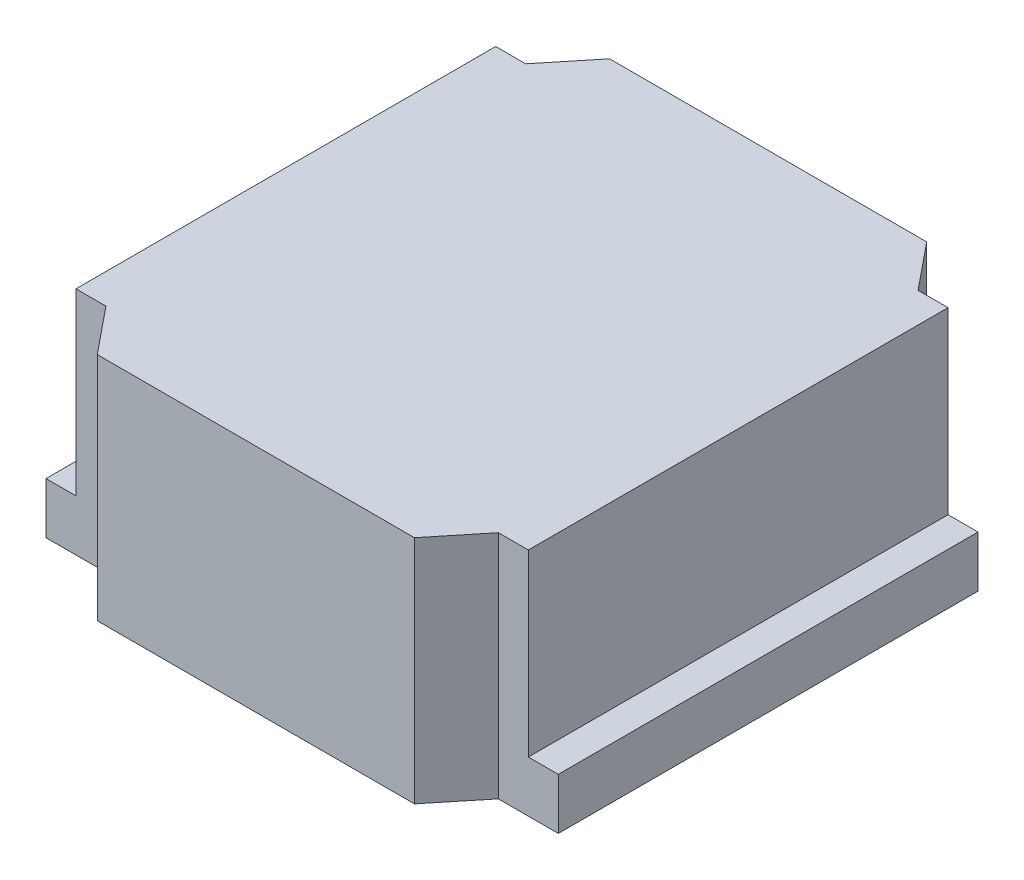
ISO-10303-21;
HEADER;
FILE_DESCRIPTION(('STEP AP214'),'2;1');
FILE_NAME('part.step','',(''),(''),'','','');
FILE_SCHEMA(('AUTOMOTIVE_DESIGN { 1 0 10303 214 1 1 1 1 }'));
ENDSEC;
DATA;
#1=APPLICATION_CONTEXT('core data for automotive mechanical design processes');
#2=APPLICATION_PROTOCOL_DEFINITION('international standard','automotive_design',2000,#1);
#3=PRODUCT_CONTEXT('',#1,'mechanical');
#4=PRODUCT('Part','Part','',(#3));
#5=PRODUCT_RELATED_PRODUCT_CATEGORY('part','',(#4));
#6=PRODUCT_DEFINITION_FORMATION('','',#4);
#7=PRODUCT_DEFINITION_CONTEXT('part definition',#1,'design');
#8=PRODUCT_DEFINITION('design','',#6,#7);
#9=PRODUCT_DEFINITION_SHAPE('','',#8);
#10=(LENGTH_UNIT() NAMED_UNIT(*) SI_UNIT(.MILLI.,.METRE.));
#11=(NAMED_UNIT(*) PLANE_ANGLE_UNIT() SI_UNIT($,.RADIAN.));
#12=(NAMED_UNIT(*) SI_UNIT($,.STERADIAN.) SOLID_ANGLE_UNIT());
#13=UNCERTAINTY_MEASURE_WITH_UNIT(LENGTH_MEASURE(1.E-05),#10,'distance_accuracy_value','');
#14=(GEOMETRIC_REPRESENTATION_CONTEXT(3) GLOBAL_UNCERTAINTY_ASSIGNED_CONTEXT((#13)) GLOBAL_UNIT_ASSIGNED_CONTEXT((#10,
#11,#12)) REPRESENTATION_CONTEXT('',''));
#15=CARTESIAN_POINT('',(0.,0.,0.));
#16=DIRECTION('',(0.,0.,1.));
#17=DIRECTION('',(1.,0.,0.));
#18=AXIS2_PLACEMENT_3D('',#15,#16,#17);
#19=CARTESIAN_POINT('',(6.23198911933,0.85,-22.06354621674));
#20=DIRECTION('',(0.,0.,1.));
#21=DIRECTION('',(1.,0.,0.));
#22=AXIS2_PLACEMENT_3D('',#19,#20,#21);
#23=PLANE('',#22);
#24=DIRECTION('',(1.,0.,0.));
#25=VECTOR('',#24,1.);
#26=CARTESIAN_POINT('',(6.465994559665,0.85,-22.06354621674));
#27=LINE('',#26,#25);
#28=CARTESIAN_POINT('',(6.23198911933,0.85,-22.0635462167398));
#29=VERTEX_POINT('',#28);
#30=CARTESIAN_POINT('',(6.7,0.85,-22.0635462167398));
#31=VERTEX_POINT('',#30);
#32=EDGE_CURVE('E248',#29,#31,#27,.T.);
#33=ORIENTED_EDGE('',*,*,#32,.F.);
#34=DIRECTION('',(0.,1.,0.));
#35=VECTOR('',#34,1.);
#36=CARTESIAN_POINT('',(6.23198911933,1.75,-22.06354621674));
#37=LINE('',#36,#35);
#38=CARTESIAN_POINT('',(6.23198911932959,2.65,-22.06354621674));
#39=VERTEX_POINT('',#38);
#40=EDGE_CURVE('E159',#29,#39,#37,.T.);
#41=ORIENTED_EDGE('',*,*,#40,.T.);
#42=DIRECTION('',(-1.,0.,0.));
#43=VECTOR('',#42,1.);
#44=CARTESIAN_POINT('',(6.465994559665,2.65,-22.06354621674));
#45=LINE('',#44,#43);
#46=CARTESIAN_POINT('',(6.46599455966502,2.65,-22.0635462167398));
#47=VERTEX_POINT('',#46);
#48=EDGE_CURVE('E251',#47,#39,#45,.T.);
#49=ORIENTED_EDGE('',*,*,#48,.F.);
#50=DIRECTION('',(0.,1.,0.));
#51=VECTOR('',#50,1.);
#52=CARTESIAN_POINT('',(6.465994559665,1.95,-22.06354621674));
#53=LINE('',#52,#51);
#54=CARTESIAN_POINT('',(6.46599455966503,1.25,-22.06354621674));
#55=VERTEX_POINT('',#54);
#56=EDGE_CURVE('E221',#55,#47,#53,.T.);
#57=ORIENTED_EDGE('',*,*,#56,.F.);
#58=DIRECTION('',(-1.,0.,0.));
#59=VECTOR('',#58,1.);
#60=CARTESIAN_POINT('',(6.465994559665,1.25,-22.06354621674));
#61=LINE('',#60,#59);
#62=CARTESIAN_POINT('',(6.7,1.25,-22.06354621674));
#63=VERTEX_POINT('',#62);
#64=EDGE_CURVE('E252',#63,#55,#61,.T.);
#65=ORIENTED_EDGE('',*,*,#64,.F.);
#66=DIRECTION('',(0.,1.,0.));
#67=VECTOR('',#66,1.);
#68=CARTESIAN_POINT('',(6.7,1.75,-22.06354621674));
#69=LINE('',#68,#67);
#70=EDGE_CURVE('E166',#31,#63,#69,.T.);
#71=ORIENTED_EDGE('',*,*,#70,.F.);
#72=EDGE_LOOP('',(#33,#41,#49,#57,#65,#71));
#73=FACE_BOUND('',#72,.T.);
#74=ADVANCED_FACE('F17',(#73),#23,.F.);
#75=CARTESIAN_POINT('',(2.7,0.85,-22.06354621674));
#76=DIRECTION('',(0.,0.,1.));
#77=DIRECTION('',(1.,0.,0.));
#78=AXIS2_PLACEMENT_3D('',#75,#76,#77);
#79=PLANE('',#78);
#80=DIRECTION('',(0.,-1.,0.));
#81=VECTOR('',#80,1.);
#82=CARTESIAN_POINT('',(2.7,1.75,-22.06354621674));
#83=LINE('',#82,#81);
#84=CARTESIAN_POINT('',(2.7,1.25,-22.06354621674));
#85=VERTEX_POINT('',#84);
#86=CARTESIAN_POINT('',(2.7,0.85,-22.0635462167398));
#87=VERTEX_POINT('',#86);
#88=EDGE_CURVE('E241',#85,#87,#83,.T.);
#89=ORIENTED_EDGE('',*,*,#88,.F.);
#90=DIRECTION('',(-1.,0.,0.));
#91=VECTOR('',#90,1.);
#92=CARTESIAN_POINT('',(2.934005440335,1.25,-22.06354621674));
#93=LINE('',#92,#91);
#94=CARTESIAN_POINT('',(2.93400544033503,1.25,-22.06354621674));
#95=VERTEX_POINT('',#94);
#96=EDGE_CURVE('E165',#95,#85,#93,.T.);
#97=ORIENTED_EDGE('',*,*,#96,.F.);
#98=DIRECTION('',(0.,-1.,0.));
#99=VECTOR('',#98,1.);
#100=CARTESIAN_POINT('',(2.934005440335,1.95,-22.06354621674));
#101=LINE('',#100,#99);
#102=CARTESIAN_POINT('',(2.93400544033502,2.65,-22.0635462167398));
#103=VERTEX_POINT('',#102);
#104=EDGE_CURVE('E224',#103,#95,#101,.T.);
#105=ORIENTED_EDGE('',*,*,#104,.F.);
#106=DIRECTION('',(-1.,0.,0.));
#107=VECTOR('',#106,1.);
#108=CARTESIAN_POINT('',(2.934005440335,2.65,-22.06354621674));
#109=LINE('',#108,#107);
#110=CARTESIAN_POINT('',(3.16801088067041,2.65,-22.06354621674));
#111=VERTEX_POINT('',#110);
#112=EDGE_CURVE('E163',#111,#103,#109,.T.);
#113=ORIENTED_EDGE('',*,*,#112,.F.);
#114=DIRECTION('',(0.,-1.,0.));
#115=VECTOR('',#114,1.);
#116=CARTESIAN_POINT('',(3.16801088067,1.75,-22.06354621674));
#117=LINE('',#116,#115);
#118=CARTESIAN_POINT('',(3.16801088067,0.85,-22.0635462167398));
#119=VERTEX_POINT('',#118);
#120=EDGE_CURVE('E146',#111,#119,#117,.T.);
#121=ORIENTED_EDGE('',*,*,#120,.T.);
#122=DIRECTION('',(1.,0.,0.));
#123=VECTOR('',#122,1.);
#124=CARTESIAN_POINT('',(2.934005440335,0.85,-22.06354621674));
#125=LINE('',#124,#123);
#126=EDGE_CURVE('E173',#87,#119,#125,.T.);
#127=ORIENTED_EDGE('',*,*,#126,.F.);
#128=EDGE_LOOP('',(#89,#97,#105,#113,#121,#127));
#129=FACE_BOUND('',#128,.T.);
#130=ADVANCED_FACE('F301',(#129),#79,.F.);
#131=CARTESIAN_POINT('',(3.16801088067,0.85,-18.78645378326));
#132=DIRECTION('',(0.,0.,-1.));
#133=DIRECTION('',(-1.,0.,0.));
#134=AXIS2_PLACEMENT_3D('',#131,#132,#133);
#135=PLANE('',#134);
#136=DIRECTION('',(-1.,0.,0.));
#137=VECTOR('',#136,1.);
#138=CARTESIAN_POINT('',(2.934005440335,0.85,-18.78645378326));
#139=LINE('',#138,#137);
#140=CARTESIAN_POINT('',(3.16801088067,0.85,-18.7864537832602));
#141=VERTEX_POINT('',#140);
#142=CARTESIAN_POINT('',(2.7,0.85,-18.7864537832602));
#143=VERTEX_POINT('',#142);
#144=EDGE_CURVE('E172',#141,#143,#139,.T.);
#145=ORIENTED_EDGE('',*,*,#144,.F.);
#146=DIRECTION('',(0.,1.,0.));
#147=VECTOR('',#146,1.);
#148=CARTESIAN_POINT('',(3.16801088067,1.75,-18.78645378326));
#149=LINE('',#148,#147);
#150=CARTESIAN_POINT('',(3.16801088067041,2.65,-18.78645378326));
#151=VERTEX_POINT('',#150);
#152=EDGE_CURVE('E174',#141,#151,#149,.T.);
#153=ORIENTED_EDGE('',*,*,#152,.T.);
#154=DIRECTION('',(1.,0.,0.));
#155=VECTOR('',#154,1.);
#156=CARTESIAN_POINT('',(2.934005440335,2.65,-18.78645378326));
#157=LINE('',#156,#155);
#158=CARTESIAN_POINT('',(2.93400544033498,2.65,-18.7864537832602));
#159=VERTEX_POINT('',#158);
#160=EDGE_CURVE('E170',#159,#151,#157,.T.);
#161=ORIENTED_EDGE('',*,*,#160,.F.);
#162=DIRECTION('',(0.,1.,0.));
#163=VECTOR('',#162,1.);
#164=CARTESIAN_POINT('',(2.934005440335,1.95,-18.78645378326));
#165=LINE('',#164,#163);
#166=CARTESIAN_POINT('',(2.93400544033499,1.25,-18.78645378326));
#167=VERTEX_POINT('',#166);
#168=EDGE_CURVE('E227',#167,#159,#165,.T.);
#169=ORIENTED_EDGE('',*,*,#168,.F.);
#170=DIRECTION('',(1.,0.,0.));
#171=VECTOR('',#170,1.);
#172=CARTESIAN_POINT('',(4.7,1.25,-18.78645378326));
#173=LINE('',#172,#171);
#174=CARTESIAN_POINT('',(2.7,1.25,-18.78645378326));
#175=VERTEX_POINT('',#174);
#176=EDGE_CURVE('E178',#175,#167,#173,.T.);
#177=ORIENTED_EDGE('',*,*,#176,.F.);
#178=DIRECTION('',(0.,1.,0.));
#179=VECTOR('',#178,1.);
#180=CARTESIAN_POINT('',(2.7,1.75,-18.78645378326));
#181=LINE('',#180,#179);
#182=EDGE_CURVE('E190',#143,#175,#181,.T.);
#183=ORIENTED_EDGE('',*,*,#182,.F.);
#184=EDGE_LOOP('',(#145,#153,#161,#169,#177,#183));
#185=FACE_BOUND('',#184,.T.);
#186=ADVANCED_FACE('F294',(#185),#135,.F.);
#187=CARTESIAN_POINT('',(6.7,0.85,-18.78645378326));
#188=DIRECTION('',(0.,0.,-1.));
#189=DIRECTION('',(-1.,0.,0.));
#190=AXIS2_PLACEMENT_3D('',#187,#188,#189);
#191=PLANE('',#190);
#192=DIRECTION('',(0.,-1.,0.));
#193=VECTOR('',#192,1.);
#194=CARTESIAN_POINT('',(6.7,1.75,-18.78645378326));
#195=LINE('',#194,#193);
#196=CARTESIAN_POINT('',(6.7,1.25,-18.78645378326));
#197=VERTEX_POINT('',#196);
#198=CARTESIAN_POINT('',(6.7,0.85,-18.7864537832602));
#199=VERTEX_POINT('',#198);
#200=EDGE_CURVE('E232',#197,#199,#195,.T.);
#201=ORIENTED_EDGE('',*,*,#200,.F.);
#202=DIRECTION('',(1.,0.,0.));
#203=VECTOR('',#202,1.);
#204=CARTESIAN_POINT('',(6.465994559665,1.25,-18.78645378326));
#205=LINE('',#204,#203);
#206=CARTESIAN_POINT('',(6.46599455966498,1.25,-18.78645378326));
#207=VERTEX_POINT('',#206);
#208=EDGE_CURVE('E189',#207,#197,#205,.T.);
#209=ORIENTED_EDGE('',*,*,#208,.F.);
#210=DIRECTION('',(0.,-1.,0.));
#211=VECTOR('',#210,1.);
#212=CARTESIAN_POINT('',(6.465994559665,1.95,-18.78645378326));
#213=LINE('',#212,#211);
#214=CARTESIAN_POINT('',(6.46599455966498,2.65,-18.7864537832602));
#215=VERTEX_POINT('',#214);
#216=EDGE_CURVE('E218',#215,#207,#213,.T.);
#217=ORIENTED_EDGE('',*,*,#216,.F.);
#218=DIRECTION('',(1.,0.,0.));
#219=VECTOR('',#218,1.);
#220=CARTESIAN_POINT('',(6.465994559665,2.65,-18.78645378326));
#221=LINE('',#220,#219);
#222=CARTESIAN_POINT('',(6.23198911932959,2.65,-18.78645378326));
#223=VERTEX_POINT('',#222);
#224=EDGE_CURVE('E187',#223,#215,#221,.T.);
#225=ORIENTED_EDGE('',*,*,#224,.F.);
#226=DIRECTION('',(0.,-1.,0.));
#227=VECTOR('',#226,1.);
#228=CARTESIAN_POINT('',(6.23198911933,1.75,-18.78645378326));
#229=LINE('',#228,#227);
#230=CARTESIAN_POINT('',(6.23198911933,0.85,-18.7864537832602));
#231=VERTEX_POINT('',#230);
#232=EDGE_CURVE('E191',#223,#231,#229,.T.);
#233=ORIENTED_EDGE('',*,*,#232,.T.);
#234=DIRECTION('',(-1.,0.,0.));
#235=VECTOR('',#234,1.);
#236=CARTESIAN_POINT('',(6.465994559665,0.85,-18.78645378326));
#237=LINE('',#236,#235);
#238=EDGE_CURVE('E230',#199,#231,#237,.T.);
#239=ORIENTED_EDGE('',*,*,#238,.F.);
#240=EDGE_LOOP('',(#201,#209,#217,#225,#233,#239));
#241=FACE_BOUND('',#240,.T.);
#242=ADVANCED_FACE('F278',(#241),#191,.F.);
#243=CARTESIAN_POINT('',(2.934005440335,1.25,-22.06354621674));
#244=DIRECTION('',(-1.,0.,0.));
#245=DIRECTION('',(0.,0.,1.));
#246=AXIS2_PLACEMENT_3D('',#243,#244,#245);
#247=PLANE('',#246);
#248=DIRECTION('',(0.,0.,1.));
#249=VECTOR('',#248,1.);
#250=CARTESIAN_POINT('',(2.934005440335,2.65,-20.425));
#251=LINE('',#250,#249);
#252=EDGE_CURVE('E148',#103,#159,#251,.T.);
#253=ORIENTED_EDGE('',*,*,#252,.F.);
#254=ORIENTED_EDGE('',*,*,#104,.T.);
#255=DIRECTION('',(0.,0.,-1.));
#256=VECTOR('',#255,1.);
#257=CARTESIAN_POINT('',(2.934005440335,1.25,-20.425));
#258=LINE('',#257,#256);
#259=EDGE_CURVE('E212',#167,#95,#258,.T.);
#260=ORIENTED_EDGE('',*,*,#259,.F.);
#261=ORIENTED_EDGE('',*,*,#168,.T.);
#262=EDGE_LOOP('',(#253,#254,#260,#261));
#263=FACE_BOUND('',#262,.T.);
#264=ADVANCED_FACE('F305',(#263),#247,.T.);
#265=CARTESIAN_POINT('',(6.465994559665,1.25,-18.78645378326));
#266=DIRECTION('',(1.,0.,0.));
#267=DIRECTION('',(0.,0.,-1.));
#268=AXIS2_PLACEMENT_3D('',#265,#266,#267);
#269=PLANE('',#268);
#270=DIRECTION('',(0.,0.,-1.));
#271=VECTOR('',#270,1.);
#272=CARTESIAN_POINT('',(6.465994559665,2.65,-20.425));
#273=LINE('',#272,#271);
#274=EDGE_CURVE('E195',#215,#47,#273,.T.);
#275=ORIENTED_EDGE('',*,*,#274,.F.);
#276=ORIENTED_EDGE('',*,*,#216,.T.);
#277=DIRECTION('',(0.,0.,1.));
#278=VECTOR('',#277,1.);
#279=CARTESIAN_POINT('',(6.465994559665,1.25,-20.425));
#280=LINE('',#279,#278);
#281=EDGE_CURVE('E161',#55,#207,#280,.T.);
#282=ORIENTED_EDGE('',*,*,#281,.F.);
#283=ORIENTED_EDGE('',*,*,#56,.T.);
#284=EDGE_LOOP('',(#275,#276,#282,#283));
#285=FACE_BOUND('',#284,.T.);
#286=ADVANCED_FACE('F275',(#285),#269,.T.);
#287=CARTESIAN_POINT('',(5.938248700264,0.85,-22.425));
#288=DIRECTION('',(-0.776051768894798,0.,0.630669209645798));
#289=DIRECTION('',(0.630669209645798,0.,0.776051768894798));
#290=AXIS2_PLACEMENT_3D('',#287,#288,#289);
#291=PLANE('',#290);
#292=DIRECTION('',(0.,-1.,0.));
#293=VECTOR('',#292,1.);
#294=CARTESIAN_POINT('',(5.938248700264,1.75,-22.425));
#295=LINE('',#294,#293);
#296=CARTESIAN_POINT('',(5.938248700264,2.65,-22.425));
#297=VERTEX_POINT('',#296);
#298=CARTESIAN_POINT('',(5.938248700264,0.85,-22.425));
#299=VERTEX_POINT('',#298);
#300=EDGE_CURVE('E140',#297,#299,#295,.T.);
#301=ORIENTED_EDGE('',*,*,#300,.F.);
#302=DIRECTION('',(-0.63066920964475,0.,-0.776051768895649));
#303=VECTOR('',#302,1.);
#304=CARTESIAN_POINT('',(6.23198911933,2.65,-22.063546216739));
#305=LINE('',#304,#303);
#306=EDGE_CURVE('E151',#39,#297,#305,.T.);
#307=ORIENTED_EDGE('',*,*,#306,.F.);
#308=ORIENTED_EDGE('',*,*,#40,.F.);
#309=DIRECTION('',(0.630669209645798,0.,0.776051768894798));
#310=VECTOR('',#309,1.);
#311=CARTESIAN_POINT('',(6.085118909797,0.85,-22.24427310837));
#312=LINE('',#311,#310);
#313=EDGE_CURVE('E169',#299,#29,#312,.T.);
#314=ORIENTED_EDGE('',*,*,#313,.F.);
#315=EDGE_LOOP('',(#301,#307,#308,#314));
#316=FACE_BOUND('',#315,.T.);
#317=ADVANCED_FACE('F260',(#316),#291,.F.);
#318=CARTESIAN_POINT('',(3.16801088067,0.85,-22.06354621674));
#319=DIRECTION('',(0.776051768894797,0.,0.6306692096458));
#320=DIRECTION('',(0.6306692096458,0.,-0.776051768894797));
#321=AXIS2_PLACEMENT_3D('',#318,#319,#320);
#322=PLANE('',#321);
#323=ORIENTED_EDGE('',*,*,#120,.F.);
#324=DIRECTION('',(-0.630669209644754,0.,0.776051768895646));
#325=VECTOR('',#324,1.);
#326=CARTESIAN_POINT('',(3.461751299736,2.65,-22.425));
#327=LINE('',#326,#325);
#328=CARTESIAN_POINT('',(3.461751299736,2.65,-22.425));
#329=VERTEX_POINT('',#328);
#330=EDGE_CURVE('E21',#329,#111,#327,.T.);
#331=ORIENTED_EDGE('',*,*,#330,.F.);
#332=DIRECTION('',(0.,1.,0.));
#333=VECTOR('',#332,1.);
#334=CARTESIAN_POINT('',(3.461751299736,1.75,-22.425));
#335=LINE('',#334,#333);
#336=CARTESIAN_POINT('',(3.461751299736,0.85,-22.425));
#337=VERTEX_POINT('',#336);
#338=EDGE_CURVE('E129',#337,#329,#335,.T.);
#339=ORIENTED_EDGE('',*,*,#338,.F.);
#340=DIRECTION('',(0.6306692096458,0.,-0.776051768894797));
#341=VECTOR('',#340,1.);
#342=CARTESIAN_POINT('',(3.314881090203,0.85,-22.24427310837));
#343=LINE('',#342,#341);
#344=EDGE_CURVE('E168',#119,#337,#343,.T.);
#345=ORIENTED_EDGE('',*,*,#344,.F.);
#346=EDGE_LOOP('',(#323,#331,#339,#345));
#347=FACE_BOUND('',#346,.T.);
#348=ADVANCED_FACE('F144',(#347),#322,.F.);
#349=CARTESIAN_POINT('',(2.7,1.25,-22.06354621674));
#350=DIRECTION('',(0.,1.,0.));
#351=DIRECTION('',(0.,0.,1.));
#352=AXIS2_PLACEMENT_3D('',#349,#350,#351);
#353=PLANE('',#352);
#354=DIRECTION('',(0.,0.,-1.));
#355=VECTOR('',#354,1.);
#356=CARTESIAN_POINT('',(2.7,1.25,-20.425));
#357=LINE('',#356,#355);
#358=EDGE_CURVE('E152',#175,#85,#357,.T.);
#359=ORIENTED_EDGE('',*,*,#358,.F.);
#360=ORIENTED_EDGE('',*,*,#176,.T.);
#361=ORIENTED_EDGE('',*,*,#259,.T.);
#362=ORIENTED_EDGE('',*,*,#96,.T.);
#363=EDGE_LOOP('',(#359,#360,#361,#362));
#364=FACE_BOUND('',#363,.T.);
#365=ADVANCED_FACE('F307',(#364),#353,.T.);
#366=CARTESIAN_POINT('',(3.461751299736,0.85,-18.425));
#367=DIRECTION('',(0.776051768894797,0.,-0.6306692096458));
#368=DIRECTION('',(-0.6306692096458,0.,-0.776051768894797));
#369=AXIS2_PLACEMENT_3D('',#366,#367,#368);
#370=PLANE('',#369);
#371=DIRECTION('',(0.,-1.,0.));
#372=VECTOR('',#371,1.);
#373=CARTESIAN_POINT('',(3.461751299736,1.75,-18.425));
#374=LINE('',#373,#372);
#375=CARTESIAN_POINT('',(3.461751299736,2.65,-18.425));
#376=VERTEX_POINT('',#375);
#377=CARTESIAN_POINT('',(3.461751299736,0.85,-18.425));
#378=VERTEX_POINT('',#377);
#379=EDGE_CURVE('E155',#376,#378,#374,.T.);
#380=ORIENTED_EDGE('',*,*,#379,.F.);
#381=DIRECTION('',(0.630669209644746,0.,0.776051768895652));
#382=VECTOR('',#381,1.);
#383=CARTESIAN_POINT('',(3.16801088067,2.65,-18.786453783261));
#384=LINE('',#383,#382);
#385=EDGE_CURVE('E198',#151,#376,#384,.T.);
#386=ORIENTED_EDGE('',*,*,#385,.F.);
#387=ORIENTED_EDGE('',*,*,#152,.F.);
#388=DIRECTION('',(-0.6306692096458,0.,-0.776051768894797));
#389=VECTOR('',#388,1.);
#390=CARTESIAN_POINT('',(3.314881090203,0.85,-18.60572689163));
#391=LINE('',#390,#389);
#392=EDGE_CURVE('E177',#378,#141,#391,.T.);
#393=ORIENTED_EDGE('',*,*,#392,.F.);
#394=EDGE_LOOP('',(#380,#386,#387,#393));
#395=FACE_BOUND('',#394,.T.);
#396=ADVANCED_FACE('F292',(#395),#370,.F.);
#397=CARTESIAN_POINT('',(6.23198911933,0.85,-18.78645378326));
#398=DIRECTION('',(-0.776051768894798,0.,-0.630669209645798));
#399=DIRECTION('',(-0.630669209645798,0.,0.776051768894798));
#400=AXIS2_PLACEMENT_3D('',#397,#398,#399);
#401=PLANE('',#400);
#402=ORIENTED_EDGE('',*,*,#232,.F.);
#403=DIRECTION('',(0.63066920964475,0.,-0.776051768895649));
#404=VECTOR('',#403,1.);
#405=CARTESIAN_POINT('',(5.938248700264,2.65,-18.425));
#406=LINE('',#405,#404);
#407=CARTESIAN_POINT('',(5.938248700264,2.65,-18.425));
#408=VERTEX_POINT('',#407);
#409=EDGE_CURVE('E196',#408,#223,#406,.T.);
#410=ORIENTED_EDGE('',*,*,#409,.F.);
#411=DIRECTION('',(0.,1.,0.));
#412=VECTOR('',#411,1.);
#413=CARTESIAN_POINT('',(5.938248700264,1.75,-18.425));
#414=LINE('',#413,#412);
#415=CARTESIAN_POINT('',(5.938248700264,0.85,-18.425));
#416=VERTEX_POINT('',#415);
#417=EDGE_CURVE('E183',#416,#408,#414,.T.);
#418=ORIENTED_EDGE('',*,*,#417,.F.);
#419=DIRECTION('',(-0.630669209645798,0.,0.776051768894798));
#420=VECTOR('',#419,1.);
#421=CARTESIAN_POINT('',(6.085118909797,0.85,-18.60572689163));
#422=LINE('',#421,#420);
#423=EDGE_CURVE('E36',#231,#416,#422,.T.);
#424=ORIENTED_EDGE('',*,*,#423,.F.);
#425=EDGE_LOOP('',(#402,#410,#418,#424));
#426=FACE_BOUND('',#425,.T.);
#427=ADVANCED_FACE('F283',(#426),#401,.F.);
#428=CARTESIAN_POINT('',(2.934005440335,2.65,-22.425));
#429=DIRECTION('',(0.,1.,0.));
#430=DIRECTION('',(0.,0.,1.));
#431=AXIS2_PLACEMENT_3D('',#428,#429,#430);
#432=PLANE('',#431);
#433=ORIENTED_EDGE('',*,*,#48,.T.);
#434=ORIENTED_EDGE('',*,*,#306,.T.);
#435=DIRECTION('',(1.,0.,0.));
#436=VECTOR('',#435,1.);
#437=CARTESIAN_POINT('',(4.7,2.65,-22.425));
#438=LINE('',#437,#436);
#439=EDGE_CURVE('E134',#329,#297,#438,.T.);
#440=ORIENTED_EDGE('',*,*,#439,.F.);
#441=ORIENTED_EDGE('',*,*,#330,.T.);
#442=ORIENTED_EDGE('',*,*,#112,.T.);
#443=ORIENTED_EDGE('',*,*,#252,.T.);
#444=ORIENTED_EDGE('',*,*,#160,.T.);
#445=ORIENTED_EDGE('',*,*,#385,.T.);
#446=DIRECTION('',(-1.,0.,0.));
#447=VECTOR('',#446,1.);
#448=CARTESIAN_POINT('',(4.7,2.65,-18.425));
#449=LINE('',#448,#447);
#450=EDGE_CURVE('E179',#408,#376,#449,.T.);
#451=ORIENTED_EDGE('',*,*,#450,.F.);
#452=ORIENTED_EDGE('',*,*,#409,.T.);
#453=ORIENTED_EDGE('',*,*,#224,.T.);
#454=ORIENTED_EDGE('',*,*,#274,.T.);
#455=EDGE_LOOP('',(#433,#434,#440,#441,#442,#443,#444,#445,#451,#452,#453,#454));
#456=FACE_BOUND('',#455,.T.);
#457=ADVANCED_FACE('F149',(#456),#432,.T.);
#458=CARTESIAN_POINT('',(2.7,1.25,-22.06354621674));
#459=DIRECTION('',(0.,1.,0.));
#460=DIRECTION('',(0.,0.,1.));
#461=AXIS2_PLACEMENT_3D('',#458,#459,#460);
#462=PLANE('',#461);
#463=DIRECTION('',(0.,0.,1.));
#464=VECTOR('',#463,1.);
#465=CARTESIAN_POINT('',(6.7,1.25,-20.425));
#466=LINE('',#465,#464);
#467=EDGE_CURVE('E182',#63,#197,#466,.T.);
#468=ORIENTED_EDGE('',*,*,#467,.F.);
#469=ORIENTED_EDGE('',*,*,#64,.T.);
#470=ORIENTED_EDGE('',*,*,#281,.T.);
#471=ORIENTED_EDGE('',*,*,#208,.T.);
#472=EDGE_LOOP('',(#468,#469,#470,#471));
#473=FACE_BOUND('',#472,.T.);
#474=ADVANCED_FACE('F273',(#473),#462,.T.);
#475=CARTESIAN_POINT('',(5.938248700264,0.85,-22.425));
#476=DIRECTION('',(0.,0.,-1.));
#477=DIRECTION('',(-1.,0.,0.));
#478=AXIS2_PLACEMENT_3D('',#475,#476,#477);
#479=PLANE('',#478);
#480=ORIENTED_EDGE('',*,*,#338,.T.);
#481=ORIENTED_EDGE('',*,*,#439,.T.);
#482=ORIENTED_EDGE('',*,*,#300,.T.);
#483=DIRECTION('',(-1.,0.,0.));
#484=VECTOR('',#483,1.);
#485=CARTESIAN_POINT('',(4.7,0.85,-22.425));
#486=LINE('',#485,#484);
#487=EDGE_CURVE('E137',#299,#337,#486,.T.);
#488=ORIENTED_EDGE('',*,*,#487,.T.);
#489=EDGE_LOOP('',(#480,#481,#482,#488));
#490=FACE_BOUND('',#489,.T.);
#491=ADVANCED_FACE('F131',(#490),#479,.T.);
#492=CARTESIAN_POINT('',(2.7,0.85,-22.06354621674));
#493=DIRECTION('',(-1.,0.,0.));
#494=DIRECTION('',(0.,0.,1.));
#495=AXIS2_PLACEMENT_3D('',#492,#493,#494);
#496=PLANE('',#495);
#497=ORIENTED_EDGE('',*,*,#88,.T.);
#498=DIRECTION('',(0.,0.,1.));
#499=VECTOR('',#498,1.);
#500=CARTESIAN_POINT('',(2.7,0.85,-20.425));
#501=LINE('',#500,#499);
#502=EDGE_CURVE('E262',#87,#143,#501,.T.);
#503=ORIENTED_EDGE('',*,*,#502,.T.);
#504=ORIENTED_EDGE('',*,*,#182,.T.);
#505=ORIENTED_EDGE('',*,*,#358,.T.);
#506=EDGE_LOOP('',(#497,#503,#504,#505));
#507=FACE_BOUND('',#506,.T.);
#508=ADVANCED_FACE('F298',(#507),#496,.T.);
#509=CARTESIAN_POINT('',(3.461751299736,0.85,-18.425));
#510=DIRECTION('',(0.,0.,1.));
#511=DIRECTION('',(1.,0.,0.));
#512=AXIS2_PLACEMENT_3D('',#509,#510,#511);
#513=PLANE('',#512);
#514=ORIENTED_EDGE('',*,*,#417,.T.);
#515=ORIENTED_EDGE('',*,*,#450,.T.);
#516=ORIENTED_EDGE('',*,*,#379,.T.);
#517=DIRECTION('',(1.,0.,0.));
#518=VECTOR('',#517,1.);
#519=CARTESIAN_POINT('',(4.7,0.85,-18.425));
#520=LINE('',#519,#518);
#521=EDGE_CURVE('E27',#378,#416,#520,.T.);
#522=ORIENTED_EDGE('',*,*,#521,.T.);
#523=EDGE_LOOP('',(#514,#515,#516,#522));
#524=FACE_BOUND('',#523,.T.);
#525=ADVANCED_FACE('F287',(#524),#513,.T.);
#526=CARTESIAN_POINT('',(6.7,0.85,-18.78645378326));
#527=DIRECTION('',(1.,0.,0.));
#528=DIRECTION('',(0.,0.,-1.));
#529=AXIS2_PLACEMENT_3D('',#526,#527,#528);
#530=PLANE('',#529);
#531=ORIENTED_EDGE('',*,*,#200,.T.);
#532=DIRECTION('',(0.,0.,-1.));
#533=VECTOR('',#532,1.);
#534=CARTESIAN_POINT('',(6.7,0.85,-20.425));
#535=LINE('',#534,#533);
#536=EDGE_CURVE('E11',#199,#31,#535,.T.);
#537=ORIENTED_EDGE('',*,*,#536,.T.);
#538=ORIENTED_EDGE('',*,*,#70,.T.);
#539=ORIENTED_EDGE('',*,*,#467,.T.);
#540=EDGE_LOOP('',(#531,#537,#538,#539));
#541=FACE_BOUND('',#540,.T.);
#542=ADVANCED_FACE('F281',(#541),#530,.T.);
#543=CARTESIAN_POINT('',(2.7,0.85,-22.425));
#544=DIRECTION('',(0.,1.,0.));
#545=DIRECTION('',(0.,0.,1.));
#546=AXIS2_PLACEMENT_3D('',#543,#544,#545);
#547=PLANE('',#546);
#548=ORIENTED_EDGE('',*,*,#536,.F.);
#549=ORIENTED_EDGE('',*,*,#238,.T.);
#550=ORIENTED_EDGE('',*,*,#423,.T.);
#551=ORIENTED_EDGE('',*,*,#521,.F.);
#552=ORIENTED_EDGE('',*,*,#392,.T.);
#553=ORIENTED_EDGE('',*,*,#144,.T.);
#554=ORIENTED_EDGE('',*,*,#502,.F.);
#555=ORIENTED_EDGE('',*,*,#126,.T.);
#556=ORIENTED_EDGE('',*,*,#344,.T.);
#557=ORIENTED_EDGE('',*,*,#487,.F.);
#558=ORIENTED_EDGE('',*,*,#313,.T.);
#559=ORIENTED_EDGE('',*,*,#32,.T.);
#560=EDGE_LOOP('',(#548,#549,#550,#551,#552,#553,#554,#555,#556,#557,#558,#559));
#561=FACE_BOUND('',#560,.T.);
#562=ADVANCED_FACE('F19',(#561),#547,.F.);
#563=CLOSED_SHELL('',(#74,#130,#186,#242,#264,#286,#317,#348,#365,#396,#427,#457,#474,#491,#508,
#525,#542,#562));
#564=MANIFOLD_SOLID_BREP('B1',#563);
#565=ADVANCED_BREP_SHAPE_REPRESENTATION('',(#18,#564),#14);
#566=SHAPE_DEFINITION_REPRESENTATION(#9,#565);
ENDSEC;
END-ISO-10303-21;
